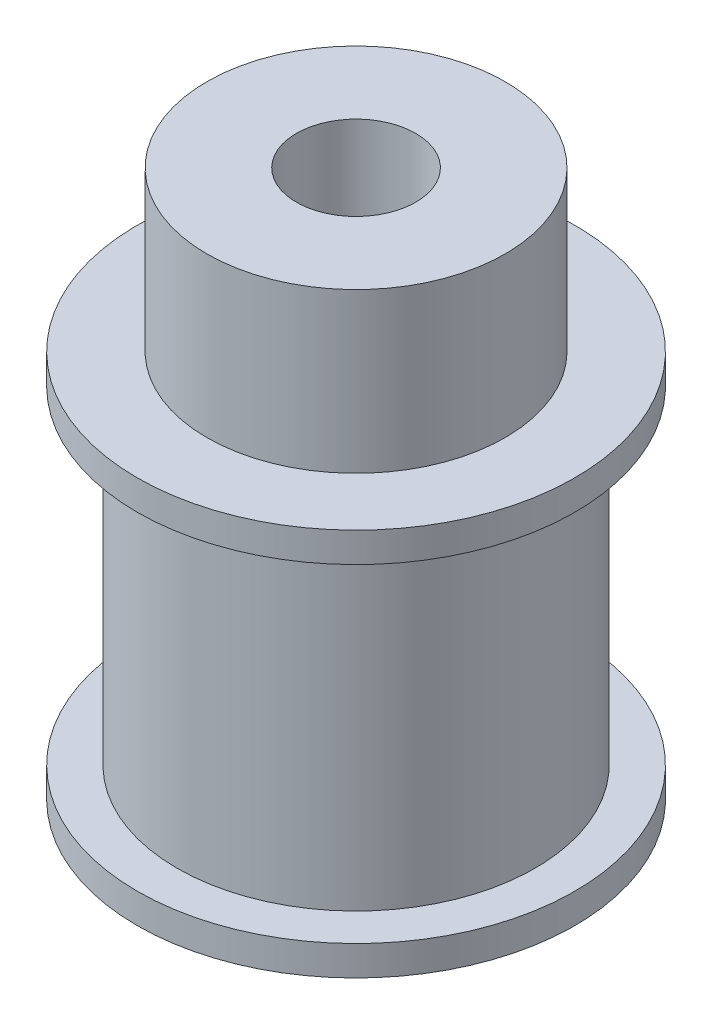
ISO-10303-21;
HEADER;
FILE_DESCRIPTION(('STEP AP214'),'2;1');
FILE_NAME('part.step','',(''),(''),'','','');
FILE_SCHEMA(('AUTOMOTIVE_DESIGN { 1 0 10303 214 1 1 1 1 }'));
ENDSEC;
DATA;
#1=APPLICATION_CONTEXT('core data for automotive mechanical design processes');
#2=APPLICATION_PROTOCOL_DEFINITION('international standard','automotive_design',2000,#1);
#3=PRODUCT_CONTEXT('',#1,'mechanical');
#4=PRODUCT('Part','Part','',(#3));
#5=PRODUCT_RELATED_PRODUCT_CATEGORY('part','',(#4));
#6=PRODUCT_DEFINITION_FORMATION('','',#4);
#7=PRODUCT_DEFINITION_CONTEXT('part definition',#1,'design');
#8=PRODUCT_DEFINITION('design','',#6,#7);
#9=PRODUCT_DEFINITION_SHAPE('','',#8);
#10=(LENGTH_UNIT() NAMED_UNIT(*) SI_UNIT(.MILLI.,.METRE.));
#11=(NAMED_UNIT(*) PLANE_ANGLE_UNIT() SI_UNIT($,.RADIAN.));
#12=(NAMED_UNIT(*) SI_UNIT($,.STERADIAN.) SOLID_ANGLE_UNIT());
#13=UNCERTAINTY_MEASURE_WITH_UNIT(LENGTH_MEASURE(1.E-05),#10,'distance_accuracy_value','');
#14=(GEOMETRIC_REPRESENTATION_CONTEXT(3) GLOBAL_UNCERTAINTY_ASSIGNED_CONTEXT((#13)) GLOBAL_UNIT_ASSIGNED_CONTEXT((#10,
#11,#12)) REPRESENTATION_CONTEXT('',''));
#15=CARTESIAN_POINT('',(0.,0.,0.));
#16=DIRECTION('',(0.,0.,1.));
#17=DIRECTION('',(1.,0.,0.));
#18=AXIS2_PLACEMENT_3D('',#15,#16,#17);
#19=CARTESIAN_POINT('',(0.,1.5,0.));
#20=DIRECTION('',(0.,-1.,0.));
#21=DIRECTION('',(0.,0.,-1.));
#22=AXIS2_PLACEMENT_3D('',#19,#20,#21);
#23=CYLINDRICAL_SURFACE('',#22,11.);
#24=CARTESIAN_POINT('',(0.,1.5,0.));
#25=DIRECTION('',(0.,1.,0.));
#26=DIRECTION('',(0.,0.,1.));
#27=AXIS2_PLACEMENT_3D('',#24,#25,#26);
#28=CIRCLE('',#27,11.);
#29=CARTESIAN_POINT('',(0.,1.5,11.));
#30=VERTEX_POINT('',#29);
#31=EDGE_CURVE('E44',#30,#30,#28,.T.);
#32=ORIENTED_EDGE('',*,*,#31,.F.);
#33=EDGE_LOOP('',(#32));
#34=FACE_BOUND('',#33,.T.);
#35=CARTESIAN_POINT('',(0.,0.,0.));
#36=DIRECTION('',(0.,1.,0.));
#37=DIRECTION('',(0.,0.,1.));
#38=AXIS2_PLACEMENT_3D('',#35,#36,#37);
#39=CIRCLE('',#38,11.);
#40=CARTESIAN_POINT('',(0.,0.,11.));
#41=VERTEX_POINT('',#40);
#42=EDGE_CURVE('E35',#41,#41,#39,.T.);
#43=ORIENTED_EDGE('',*,*,#42,.T.);
#44=EDGE_LOOP('',(#43));
#45=FACE_BOUND('',#44,.T.);
#46=ADVANCED_FACE('F32',(#34,#45),#23,.T.);
#47=CARTESIAN_POINT('',(0.,1.5,0.));
#48=DIRECTION('',(0.,1.,0.));
#49=DIRECTION('',(0.,0.,1.));
#50=AXIS2_PLACEMENT_3D('',#47,#48,#49);
#51=PLANE('',#50);
#52=CARTESIAN_POINT('',(0.,1.5,0.));
#53=DIRECTION('',(0.,1.,0.));
#54=DIRECTION('',(0.,0.,1.));
#55=AXIS2_PLACEMENT_3D('',#52,#53,#54);
#56=CIRCLE('',#55,9.);
#57=CARTESIAN_POINT('',(0.,1.5,9.));
#58=VERTEX_POINT('',#57);
#59=EDGE_CURVE('E39',#58,#58,#56,.T.);
#60=ORIENTED_EDGE('',*,*,#59,.F.);
#61=EDGE_LOOP('',(#60));
#62=FACE_BOUND('',#61,.T.);
#63=ORIENTED_EDGE('',*,*,#31,.T.);
#64=EDGE_LOOP('',(#63));
#65=FACE_BOUND('',#64,.T.);
#66=ADVANCED_FACE('F68',(#62,#65),#51,.T.);
#67=CARTESIAN_POINT('',(0.,0.,0.));
#68=DIRECTION('',(0.,1.,0.));
#69=DIRECTION('',(0.,0.,1.));
#70=AXIS2_PLACEMENT_3D('',#67,#68,#69);
#71=PLANE('',#70);
#72=CARTESIAN_POINT('',(0.,0.,0.));
#73=DIRECTION('',(0.,-1.,0.));
#74=DIRECTION('',(0.,0.,-1.));
#75=AXIS2_PLACEMENT_3D('',#72,#73,#74);
#76=CIRCLE('',#75,3.);
#77=CARTESIAN_POINT('',(0.,0.,-3.));
#78=VERTEX_POINT('',#77);
#79=EDGE_CURVE('E166',#78,#78,#76,.T.);
#80=ORIENTED_EDGE('',*,*,#79,.F.);
#81=EDGE_LOOP('',(#80));
#82=FACE_BOUND('',#81,.T.);
#83=ORIENTED_EDGE('',*,*,#42,.F.);
#84=EDGE_LOOP('',(#83));
#85=FACE_BOUND('',#84,.T.);
#86=ADVANCED_FACE('F65',(#82,#85),#71,.F.);
#87=CARTESIAN_POINT('',(0.,18.,0.));
#88=DIRECTION('',(0.,-1.,0.));
#89=DIRECTION('',(0.,0.,-1.));
#90=AXIS2_PLACEMENT_3D('',#87,#88,#89);
#91=CYLINDRICAL_SURFACE('',#90,9.);
#92=CARTESIAN_POINT('',(0.,18.,0.));
#93=DIRECTION('',(0.,1.,0.));
#94=DIRECTION('',(0.,0.,1.));
#95=AXIS2_PLACEMENT_3D('',#92,#93,#94);
#96=CIRCLE('',#95,9.);
#97=CARTESIAN_POINT('',(0.,18.,9.));
#98=VERTEX_POINT('',#97);
#99=EDGE_CURVE('E53',#98,#98,#96,.T.);
#100=ORIENTED_EDGE('',*,*,#99,.F.);
#101=EDGE_LOOP('',(#100));
#102=FACE_BOUND('',#101,.T.);
#103=ORIENTED_EDGE('',*,*,#59,.T.);
#104=EDGE_LOOP('',(#103));
#105=FACE_BOUND('',#104,.T.);
#106=ADVANCED_FACE('F67',(#102,#105),#91,.T.);
#107=CARTESIAN_POINT('',(0.,19.5,0.));
#108=DIRECTION('',(0.,-1.,0.));
#109=DIRECTION('',(0.,0.,-1.));
#110=AXIS2_PLACEMENT_3D('',#107,#108,#109);
#111=CYLINDRICAL_SURFACE('',#110,11.);
#112=CARTESIAN_POINT('',(0.,19.5,0.));
#113=DIRECTION('',(0.,1.,0.));
#114=DIRECTION('',(0.,0.,1.));
#115=AXIS2_PLACEMENT_3D('',#112,#113,#114);
#116=CIRCLE('',#115,11.);
#117=CARTESIAN_POINT('',(0.,19.5,11.));
#118=VERTEX_POINT('',#117);
#119=EDGE_CURVE('E50',#118,#118,#116,.T.);
#120=ORIENTED_EDGE('',*,*,#119,.F.);
#121=EDGE_LOOP('',(#120));
#122=FACE_BOUND('',#121,.T.);
#123=CARTESIAN_POINT('',(0.,18.,0.));
#124=DIRECTION('',(0.,1.,0.));
#125=DIRECTION('',(0.,0.,1.));
#126=AXIS2_PLACEMENT_3D('',#123,#124,#125);
#127=CIRCLE('',#126,11.);
#128=CARTESIAN_POINT('',(0.,18.,11.));
#129=VERTEX_POINT('',#128);
#130=EDGE_CURVE('E54',#129,#129,#127,.T.);
#131=ORIENTED_EDGE('',*,*,#130,.T.);
#132=EDGE_LOOP('',(#131));
#133=FACE_BOUND('',#132,.T.);
#134=ADVANCED_FACE('F74',(#122,#133),#111,.T.);
#135=CARTESIAN_POINT('',(0.,19.5,0.));
#136=DIRECTION('',(0.,1.,0.));
#137=DIRECTION('',(0.,0.,1.));
#138=AXIS2_PLACEMENT_3D('',#135,#136,#137);
#139=PLANE('',#138);
#140=CARTESIAN_POINT('',(0.,19.5,0.));
#141=DIRECTION('',(0.,1.,0.));
#142=DIRECTION('',(0.,0.,1.));
#143=AXIS2_PLACEMENT_3D('',#140,#141,#142);
#144=CIRCLE('',#143,7.5);
#145=CARTESIAN_POINT('',(0.,19.5,7.5));
#146=VERTEX_POINT('',#145);
#147=EDGE_CURVE('E10',#146,#146,#144,.T.);
#148=ORIENTED_EDGE('',*,*,#147,.F.);
#149=EDGE_LOOP('',(#148));
#150=FACE_BOUND('',#149,.T.);
#151=ORIENTED_EDGE('',*,*,#119,.T.);
#152=EDGE_LOOP('',(#151));
#153=FACE_BOUND('',#152,.T.);
#154=ADVANCED_FACE('F104',(#150,#153),#139,.T.);
#155=CARTESIAN_POINT('',(0.,18.,0.));
#156=DIRECTION('',(0.,1.,0.));
#157=DIRECTION('',(0.,0.,1.));
#158=AXIS2_PLACEMENT_3D('',#155,#156,#157);
#159=PLANE('',#158);
#160=ORIENTED_EDGE('',*,*,#99,.T.);
#161=EDGE_LOOP('',(#160));
#162=FACE_BOUND('',#161,.T.);
#163=ORIENTED_EDGE('',*,*,#130,.F.);
#164=EDGE_LOOP('',(#163));
#165=FACE_BOUND('',#164,.T.);
#166=ADVANCED_FACE('F112',(#162,#165),#159,.F.);
#167=CARTESIAN_POINT('',(0.,27.5,0.));
#168=DIRECTION('',(0.,-1.,0.));
#169=DIRECTION('',(0.,0.,-1.));
#170=AXIS2_PLACEMENT_3D('',#167,#168,#169);
#171=CYLINDRICAL_SURFACE('',#170,7.5);
#172=CARTESIAN_POINT('',(0.,27.5,0.));
#173=DIRECTION('',(0.,1.,0.));
#174=DIRECTION('',(0.,0.,1.));
#175=AXIS2_PLACEMENT_3D('',#172,#173,#174);
#176=CIRCLE('',#175,7.5);
#177=CARTESIAN_POINT('',(0.,27.5,7.5));
#178=VERTEX_POINT('',#177);
#179=EDGE_CURVE('E48',#178,#178,#176,.T.);
#180=ORIENTED_EDGE('',*,*,#179,.F.);
#181=EDGE_LOOP('',(#180));
#182=FACE_BOUND('',#181,.T.);
#183=ORIENTED_EDGE('',*,*,#147,.T.);
#184=EDGE_LOOP('',(#183));
#185=FACE_BOUND('',#184,.T.);
#186=ADVANCED_FACE('F117',(#182,#185),#171,.T.);
#187=CARTESIAN_POINT('',(0.,27.5,0.));
#188=DIRECTION('',(0.,1.,0.));
#189=DIRECTION('',(0.,0.,1.));
#190=AXIS2_PLACEMENT_3D('',#187,#188,#189);
#191=PLANE('',#190);
#192=CARTESIAN_POINT('',(0.,27.5,0.));
#193=DIRECTION('',(0.,-1.,0.));
#194=DIRECTION('',(0.,0.,-1.));
#195=AXIS2_PLACEMENT_3D('',#192,#193,#194);
#196=CIRCLE('',#195,3.);
#197=CARTESIAN_POINT('',(0.,27.5,-3.));
#198=VERTEX_POINT('',#197);
#199=EDGE_CURVE('E164',#198,#198,#196,.T.);
#200=ORIENTED_EDGE('',*,*,#199,.T.);
#201=EDGE_LOOP('',(#200));
#202=FACE_BOUND('',#201,.T.);
#203=ORIENTED_EDGE('',*,*,#179,.T.);
#204=EDGE_LOOP('',(#203));
#205=FACE_BOUND('',#204,.T.);
#206=ADVANCED_FACE('F133',(#202,#205),#191,.T.);
#207=CARTESIAN_POINT('',(0.,27.5,0.));
#208=DIRECTION('',(0.,-1.,0.));
#209=DIRECTION('',(0.,0.,-1.));
#210=AXIS2_PLACEMENT_3D('',#207,#208,#209);
#211=CYLINDRICAL_SURFACE('',#210,3.);
#212=ORIENTED_EDGE('',*,*,#199,.F.);
#213=EDGE_LOOP('',(#212));
#214=FACE_BOUND('',#213,.T.);
#215=ORIENTED_EDGE('',*,*,#79,.T.);
#216=EDGE_LOOP('',(#215));
#217=FACE_BOUND('',#216,.T.);
#218=ADVANCED_FACE('F147',(#214,#217),#211,.F.);
#219=CLOSED_SHELL('',(#46,#66,#86,#106,#134,#154,#166,#186,#206,#218));
#220=MANIFOLD_SOLID_BREP('B2',#219);
#221=ADVANCED_BREP_SHAPE_REPRESENTATION('',(#18,#220),#14);
#222=SHAPE_DEFINITION_REPRESENTATION(#9,#221);
ENDSEC;
END-ISO-10303-21;
